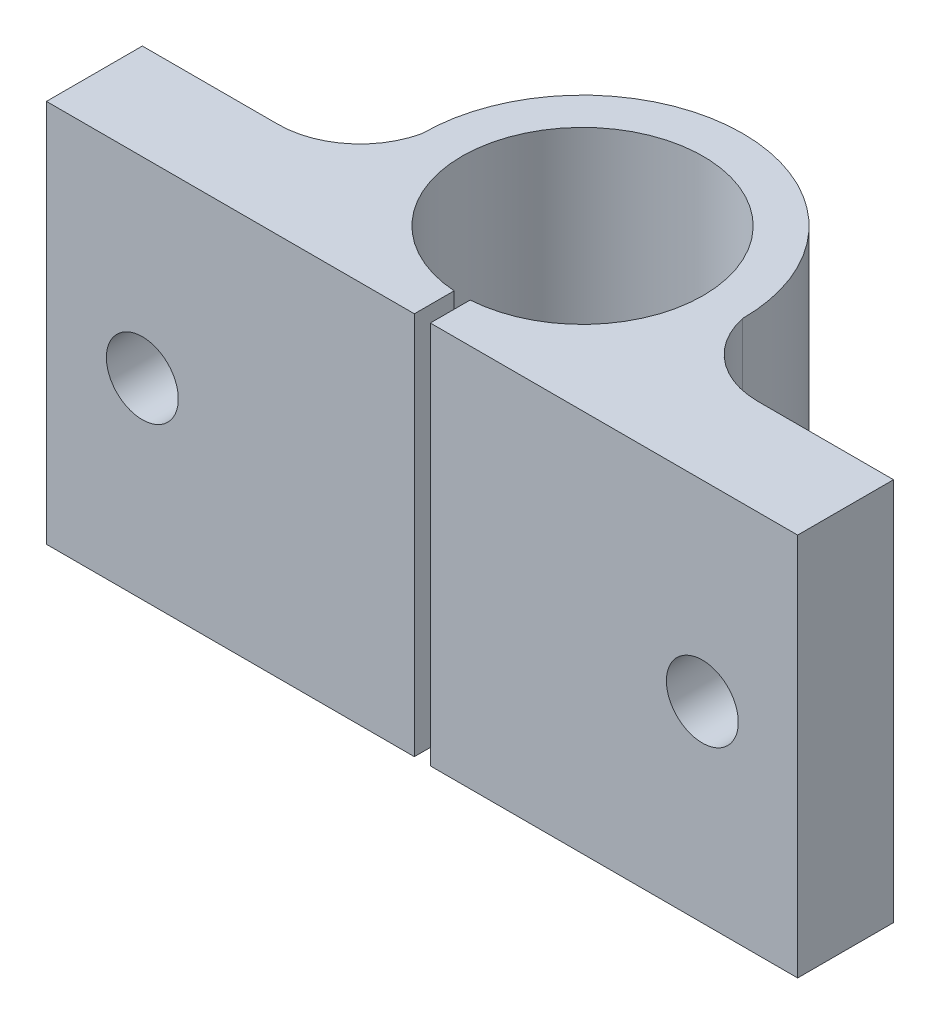
ISO-10303-21;
HEADER;
FILE_DESCRIPTION(('STEP AP214'),'2;1');
FILE_NAME('part.step','',(''),(''),'','','');
FILE_SCHEMA(('AUTOMOTIVE_DESIGN { 1 0 10303 214 1 1 1 1 }'));
ENDSEC;
DATA;
#1=APPLICATION_CONTEXT('core data for automotive mechanical design processes');
#2=APPLICATION_PROTOCOL_DEFINITION('international standard','automotive_design',2000,#1);
#3=PRODUCT_CONTEXT('',#1,'mechanical');
#4=PRODUCT('Part','Part','',(#3));
#5=PRODUCT_RELATED_PRODUCT_CATEGORY('part','',(#4));
#6=PRODUCT_DEFINITION_FORMATION('','',#4);
#7=PRODUCT_DEFINITION_CONTEXT('part definition',#1,'design');
#8=PRODUCT_DEFINITION('design','',#6,#7);
#9=PRODUCT_DEFINITION_SHAPE('','',#8);
#10=(LENGTH_UNIT() NAMED_UNIT(*) SI_UNIT(.MILLI.,.METRE.));
#11=(NAMED_UNIT(*) PLANE_ANGLE_UNIT() SI_UNIT($,.RADIAN.));
#12=(NAMED_UNIT(*) SI_UNIT($,.STERADIAN.) SOLID_ANGLE_UNIT());
#13=UNCERTAINTY_MEASURE_WITH_UNIT(LENGTH_MEASURE(1.E-05),#10,'distance_accuracy_value','');
#14=(GEOMETRIC_REPRESENTATION_CONTEXT(3) GLOBAL_UNCERTAINTY_ASSIGNED_CONTEXT((#13)) GLOBAL_UNIT_ASSIGNED_CONTEXT((#10,
#11,#12)) REPRESENTATION_CONTEXT('',''));
#15=CARTESIAN_POINT('',(0.,0.,0.));
#16=DIRECTION('',(0.,0.,1.));
#17=DIRECTION('',(1.,0.,0.));
#18=AXIS2_PLACEMENT_3D('',#15,#16,#17);
#19=CARTESIAN_POINT('',(0.,0.,0.));
#20=DIRECTION('',(0.,0.,1.));
#21=DIRECTION('',(1.,0.,0.));
#22=AXIS2_PLACEMENT_3D('',#19,#20,#21);
#23=PLANE('',#22);
#24=CARTESIAN_POINT('',(41.0372666212457,12.,0.));
#25=DIRECTION('',(0.,0.,-1.));
#26=DIRECTION('',(-1.,0.,0.));
#27=AXIS2_PLACEMENT_3D('',#24,#25,#26);
#28=CIRCLE('',#27,2.25000000000006);
#29=CARTESIAN_POINT('',(38.7872666212456,12.,0.));
#30=VERTEX_POINT('',#29);
#31=EDGE_CURVE('E222',#30,#30,#28,.T.);
#32=ORIENTED_EDGE('',*,*,#31,.T.);
#33=EDGE_LOOP('',(#32));
#34=FACE_BOUND('',#33,.T.);
#35=DIRECTION('',(0.,-1.,0.));
#36=VECTOR('',#35,1.);
#37=CARTESIAN_POINT('',(24.0186333106229,24.,0.));
#38=LINE('',#37,#36);
#39=CARTESIAN_POINT('',(24.0186333106229,24.,0.));
#40=VERTEX_POINT('',#39);
#41=CARTESIAN_POINT('',(24.0186333106229,0.,0.));
#42=VERTEX_POINT('',#41);
#43=EDGE_CURVE('E234',#40,#42,#38,.T.);
#44=ORIENTED_EDGE('',*,*,#43,.T.);
#45=DIRECTION('',(1.,0.,0.));
#46=VECTOR('',#45,1.);
#47=CARTESIAN_POINT('',(0.,0.,0.));
#48=LINE('',#47,#46);
#49=CARTESIAN_POINT('',(47.,0.,0.));
#50=VERTEX_POINT('',#49);
#51=EDGE_CURVE('E247',#42,#50,#48,.T.);
#52=ORIENTED_EDGE('',*,*,#51,.T.);
#53=DIRECTION('',(0.,1.,0.));
#54=VECTOR('',#53,1.);
#55=CARTESIAN_POINT('',(47.,0.,0.));
#56=LINE('',#55,#54);
#57=CARTESIAN_POINT('',(47.,24.,0.));
#58=VERTEX_POINT('',#57);
#59=EDGE_CURVE('E173',#50,#58,#56,.T.);
#60=ORIENTED_EDGE('',*,*,#59,.T.);
#61=DIRECTION('',(1.,0.,0.));
#62=VECTOR('',#61,1.);
#63=CARTESIAN_POINT('',(0.,24.,0.));
#64=LINE('',#63,#62);
#65=EDGE_CURVE('E147',#40,#58,#64,.T.);
#66=ORIENTED_EDGE('',*,*,#65,.F.);
#67=EDGE_LOOP('',(#44,#52,#60,#66));
#68=FACE_BOUND('',#67,.T.);
#69=ADVANCED_FACE('F32',(#34,#68),#23,.T.);
#70=CARTESIAN_POINT('',(0.,0.,-6.));
#71=DIRECTION('',(-1.,0.,0.));
#72=DIRECTION('',(0.,0.,1.));
#73=AXIS2_PLACEMENT_3D('',#70,#71,#72);
#74=PLANE('',#73);
#75=DIRECTION('',(0.,0.,1.));
#76=VECTOR('',#75,1.);
#77=CARTESIAN_POINT('',(0.,24.,-6.));
#78=LINE('',#77,#76);
#79=CARTESIAN_POINT('',(0.,24.,-6.));
#80=VERTEX_POINT('',#79);
#81=CARTESIAN_POINT('',(0.,24.,0.));
#82=VERTEX_POINT('',#81);
#83=EDGE_CURVE('E144',#80,#82,#78,.T.);
#84=ORIENTED_EDGE('',*,*,#83,.F.);
#85=DIRECTION('',(0.,1.,0.));
#86=VECTOR('',#85,1.);
#87=CARTESIAN_POINT('',(0.,0.,-6.));
#88=LINE('',#87,#86);
#89=CARTESIAN_POINT('',(0.,0.,-6.));
#90=VERTEX_POINT('',#89);
#91=EDGE_CURVE('E11',#90,#80,#88,.T.);
#92=ORIENTED_EDGE('',*,*,#91,.F.);
#93=DIRECTION('',(0.,0.,1.));
#94=VECTOR('',#93,1.);
#95=CARTESIAN_POINT('',(0.,0.,-6.));
#96=LINE('',#95,#94);
#97=CARTESIAN_POINT('',(0.,0.,0.));
#98=VERTEX_POINT('',#97);
#99=EDGE_CURVE('E166',#90,#98,#96,.T.);
#100=ORIENTED_EDGE('',*,*,#99,.T.);
#101=DIRECTION('',(0.,1.,0.));
#102=VECTOR('',#101,1.);
#103=CARTESIAN_POINT('',(0.,0.,0.));
#104=LINE('',#103,#102);
#105=EDGE_CURVE('E36',#98,#82,#104,.T.);
#106=ORIENTED_EDGE('',*,*,#105,.T.);
#107=EDGE_LOOP('',(#84,#92,#100,#106));
#108=FACE_BOUND('',#107,.T.);
#109=ADVANCED_FACE('F34',(#108),#74,.T.);
#110=CARTESIAN_POINT('',(8.50000000000001,0.,-6.));
#111=DIRECTION('',(0.,0.,-1.));
#112=DIRECTION('',(-1.,0.,0.));
#113=AXIS2_PLACEMENT_3D('',#110,#111,#112);
#114=PLANE('',#113);
#115=CARTESIAN_POINT('',(6.,12.,-6.00000000000001));
#116=DIRECTION('',(0.,0.,-1.));
#117=DIRECTION('',(-1.,0.,0.));
#118=AXIS2_PLACEMENT_3D('',#115,#116,#117);
#119=CIRCLE('',#118,2.25000000000007);
#120=CARTESIAN_POINT('',(3.74999999999994,12.,-6.00000000000001));
#121=VERTEX_POINT('',#120);
#122=EDGE_CURVE('E217',#121,#121,#119,.T.);
#123=ORIENTED_EDGE('',*,*,#122,.F.);
#124=EDGE_LOOP('',(#123));
#125=FACE_BOUND('',#124,.T.);
#126=DIRECTION('',(-1.,0.,0.));
#127=VECTOR('',#126,1.);
#128=CARTESIAN_POINT('',(8.50000000000001,24.,-6.));
#129=LINE('',#128,#127);
#130=CARTESIAN_POINT('',(8.50000000000001,24.,-6.00000000000002));
#131=VERTEX_POINT('',#130);
#132=EDGE_CURVE('E164',#131,#80,#129,.T.);
#133=ORIENTED_EDGE('',*,*,#132,.F.);
#134=DIRECTION('',(0.,1.,0.));
#135=VECTOR('',#134,1.);
#136=CARTESIAN_POINT('',(8.50000000000001,0.,-6.00000000000002));
#137=LINE('',#136,#135);
#138=CARTESIAN_POINT('',(8.50000000000001,0.,-6.00000000000002));
#139=VERTEX_POINT('',#138);
#140=EDGE_CURVE('E41',#139,#131,#137,.T.);
#141=ORIENTED_EDGE('',*,*,#140,.F.);
#142=DIRECTION('',(-1.,0.,0.));
#143=VECTOR('',#142,1.);
#144=CARTESIAN_POINT('',(8.50000000000001,0.,-6.));
#145=LINE('',#144,#143);
#146=EDGE_CURVE('E134',#139,#90,#145,.T.);
#147=ORIENTED_EDGE('',*,*,#146,.T.);
#148=ORIENTED_EDGE('',*,*,#91,.T.);
#149=EDGE_LOOP('',(#133,#141,#147,#148));
#150=FACE_BOUND('',#149,.T.);
#151=ADVANCED_FACE('F186',(#125,#150),#114,.T.);
#152=CARTESIAN_POINT('',(8.50000000000001,0.,-11.1210427356607));
#153=DIRECTION('',(0.,1.,0.));
#154=DIRECTION('',(0.,0.,1.));
#155=AXIS2_PLACEMENT_3D('',#152,#153,#154);
#156=CYLINDRICAL_SURFACE('',#155,5.12104273566066);
#157=CARTESIAN_POINT('',(8.50000000000001,24.,-11.1210427356607));
#158=DIRECTION('',(0.,-1.,0.));
#159=DIRECTION('',(0.,0.,-1.));
#160=AXIS2_PLACEMENT_3D('',#157,#158,#159);
#161=CIRCLE('',#160,5.12104273566066);
#162=CARTESIAN_POINT('',(13.4959473897421,24.,-9.99605901160399));
#163=VERTEX_POINT('',#162);
#164=EDGE_CURVE('E120',#163,#131,#161,.T.);
#165=ORIENTED_EDGE('',*,*,#164,.F.);
#166=DIRECTION('',(0.,1.,0.));
#167=VECTOR('',#166,1.);
#168=CARTESIAN_POINT('',(13.4959473897421,0.,-9.99605901160399));
#169=LINE('',#168,#167);
#170=CARTESIAN_POINT('',(13.4959473897421,0.,-9.99605901160399));
#171=VERTEX_POINT('',#170);
#172=EDGE_CURVE('E114',#171,#163,#169,.T.);
#173=ORIENTED_EDGE('',*,*,#172,.F.);
#174=CARTESIAN_POINT('',(8.50000000000001,0.,-11.1210427356607));
#175=DIRECTION('',(0.,-1.,0.));
#176=DIRECTION('',(0.,0.,-1.));
#177=AXIS2_PLACEMENT_3D('',#174,#175,#176);
#178=CIRCLE('',#177,5.12104273566066);
#179=EDGE_CURVE('E117',#171,#139,#178,.T.);
#180=ORIENTED_EDGE('',*,*,#179,.T.);
#181=ORIENTED_EDGE('',*,*,#140,.T.);
#182=EDGE_LOOP('',(#165,#173,#180,#181));
#183=FACE_BOUND('',#182,.T.);
#184=ADVANCED_FACE('F116',(#183),#156,.F.);
#185=CARTESIAN_POINT('',(23.5186333106229,0.,-10.0227213844719));
#186=DIRECTION('',(0.,1.,0.));
#187=DIRECTION('',(0.,0.,1.));
#188=AXIS2_PLACEMENT_3D('',#185,#186,#187);
#189=CYLINDRICAL_SURFACE('',#188,10.0227213844719);
#190=CARTESIAN_POINT('',(23.5186333106229,24.,-10.0227213844719));
#191=DIRECTION('',(0.,1.,0.));
#192=DIRECTION('',(0.,0.,1.));
#193=AXIS2_PLACEMENT_3D('',#190,#191,#192);
#194=CIRCLE('',#193,10.0227213844719);
#195=CARTESIAN_POINT('',(33.5413546555968,24.,-10.021831577252));
#196=VERTEX_POINT('',#195);
#197=EDGE_CURVE('E161',#196,#163,#194,.T.);
#198=ORIENTED_EDGE('',*,*,#197,.F.);
#199=DIRECTION('',(0.,1.,0.));
#200=VECTOR('',#199,1.);
#201=CARTESIAN_POINT('',(33.5413546555968,0.,-10.021831577252));
#202=LINE('',#201,#200);
#203=CARTESIAN_POINT('',(33.5413546555968,0.,-10.021831577252));
#204=VERTEX_POINT('',#203);
#205=EDGE_CURVE('E125',#204,#196,#202,.T.);
#206=ORIENTED_EDGE('',*,*,#205,.F.);
#207=CARTESIAN_POINT('',(23.5186333106229,0.,-10.0227213844719));
#208=DIRECTION('',(0.,1.,0.));
#209=DIRECTION('',(0.,0.,1.));
#210=AXIS2_PLACEMENT_3D('',#207,#208,#209);
#211=CIRCLE('',#210,10.0227213844719);
#212=EDGE_CURVE('E132',#204,#171,#211,.T.);
#213=ORIENTED_EDGE('',*,*,#212,.T.);
#214=ORIENTED_EDGE('',*,*,#172,.T.);
#215=EDGE_LOOP('',(#198,#206,#213,#214));
#216=FACE_BOUND('',#215,.T.);
#217=ADVANCED_FACE('F136',(#216),#189,.T.);
#218=CARTESIAN_POINT('',(38.5000000000001,0.,-11.0677523541657));
#219=DIRECTION('',(0.,1.,0.));
#220=DIRECTION('',(0.,0.,1.));
#221=AXIS2_PLACEMENT_3D('',#218,#219,#220);
#222=CYLINDRICAL_SURFACE('',#221,5.06775235416579);
#223=CARTESIAN_POINT('',(38.5000000000001,24.,-11.0677523541657));
#224=DIRECTION('',(0.,-1.,0.));
#225=DIRECTION('',(0.,0.,-1.));
#226=AXIS2_PLACEMENT_3D('',#223,#224,#225);
#227=CIRCLE('',#226,5.06775235416579);
#228=CARTESIAN_POINT('',(38.5,24.,-6.00000000000001));
#229=VERTEX_POINT('',#228);
#230=EDGE_CURVE('E158',#229,#196,#227,.T.);
#231=ORIENTED_EDGE('',*,*,#230,.F.);
#232=DIRECTION('',(0.,1.,0.));
#233=VECTOR('',#232,1.);
#234=CARTESIAN_POINT('',(38.5,0.,-6.00000000000001));
#235=LINE('',#234,#233);
#236=CARTESIAN_POINT('',(38.5,0.,-6.00000000000001));
#237=VERTEX_POINT('',#236);
#238=EDGE_CURVE('E170',#237,#229,#235,.T.);
#239=ORIENTED_EDGE('',*,*,#238,.F.);
#240=CARTESIAN_POINT('',(38.5000000000001,0.,-11.0677523541657));
#241=DIRECTION('',(0.,-1.,0.));
#242=DIRECTION('',(0.,0.,-1.));
#243=AXIS2_PLACEMENT_3D('',#240,#241,#242);
#244=CIRCLE('',#243,5.06775235416579);
#245=EDGE_CURVE('E137',#237,#204,#244,.T.);
#246=ORIENTED_EDGE('',*,*,#245,.T.);
#247=ORIENTED_EDGE('',*,*,#205,.T.);
#248=EDGE_LOOP('',(#231,#239,#246,#247));
#249=FACE_BOUND('',#248,.T.);
#250=ADVANCED_FACE('F305',(#249),#222,.F.);
#251=CARTESIAN_POINT('',(47.,0.,-6.));
#252=DIRECTION('',(0.,0.,-1.));
#253=DIRECTION('',(-1.,0.,0.));
#254=AXIS2_PLACEMENT_3D('',#251,#252,#253);
#255=PLANE('',#254);
#256=CARTESIAN_POINT('',(41.0372666212457,12.,-6.00000000000001));
#257=DIRECTION('',(0.,0.,-1.));
#258=DIRECTION('',(-1.,0.,0.));
#259=AXIS2_PLACEMENT_3D('',#256,#257,#258);
#260=CIRCLE('',#259,2.25000000000006);
#261=CARTESIAN_POINT('',(38.7872666212456,12.,-6.00000000000001));
#262=VERTEX_POINT('',#261);
#263=EDGE_CURVE('E301',#262,#262,#260,.T.);
#264=ORIENTED_EDGE('',*,*,#263,.F.);
#265=EDGE_LOOP('',(#264));
#266=FACE_BOUND('',#265,.T.);
#267=DIRECTION('',(-1.,0.,0.));
#268=VECTOR('',#267,1.);
#269=CARTESIAN_POINT('',(47.,24.,-6.));
#270=LINE('',#269,#268);
#271=CARTESIAN_POINT('',(47.,24.,-6.));
#272=VERTEX_POINT('',#271);
#273=EDGE_CURVE('E155',#272,#229,#270,.T.);
#274=ORIENTED_EDGE('',*,*,#273,.F.);
#275=DIRECTION('',(0.,1.,0.));
#276=VECTOR('',#275,1.);
#277=CARTESIAN_POINT('',(47.,0.,-6.));
#278=LINE('',#277,#276);
#279=CARTESIAN_POINT('',(47.,0.,-6.));
#280=VERTEX_POINT('',#279);
#281=EDGE_CURVE('E172',#280,#272,#278,.T.);
#282=ORIENTED_EDGE('',*,*,#281,.F.);
#283=DIRECTION('',(-1.,0.,0.));
#284=VECTOR('',#283,1.);
#285=CARTESIAN_POINT('',(47.,0.,-6.));
#286=LINE('',#285,#284);
#287=EDGE_CURVE('E139',#280,#237,#286,.T.);
#288=ORIENTED_EDGE('',*,*,#287,.T.);
#289=ORIENTED_EDGE('',*,*,#238,.T.);
#290=EDGE_LOOP('',(#274,#282,#288,#289));
#291=FACE_BOUND('',#290,.T.);
#292=ADVANCED_FACE('F211',(#266,#291),#255,.T.);
#293=CARTESIAN_POINT('',(47.,0.,0.));
#294=DIRECTION('',(1.,0.,0.));
#295=DIRECTION('',(0.,0.,-1.));
#296=AXIS2_PLACEMENT_3D('',#293,#294,#295);
#297=PLANE('',#296);
#298=DIRECTION('',(0.,0.,-1.));
#299=VECTOR('',#298,1.);
#300=CARTESIAN_POINT('',(47.,24.,0.));
#301=LINE('',#300,#299);
#302=EDGE_CURVE('E152',#58,#272,#301,.T.);
#303=ORIENTED_EDGE('',*,*,#302,.F.);
#304=ORIENTED_EDGE('',*,*,#59,.F.);
#305=DIRECTION('',(0.,0.,-1.));
#306=VECTOR('',#305,1.);
#307=CARTESIAN_POINT('',(47.,0.,0.));
#308=LINE('',#307,#306);
#309=EDGE_CURVE('E250',#50,#280,#308,.T.);
#310=ORIENTED_EDGE('',*,*,#309,.T.);
#311=ORIENTED_EDGE('',*,*,#281,.T.);
#312=EDGE_LOOP('',(#303,#304,#310,#311));
#313=FACE_BOUND('',#312,.T.);
#314=ADVANCED_FACE('F204',(#313),#297,.T.);
#315=CARTESIAN_POINT('',(6.,12.,0.));
#316=DIRECTION('',(0.,0.,-1.));
#317=DIRECTION('',(-1.,0.,0.));
#318=AXIS2_PLACEMENT_3D('',#315,#316,#317);
#319=CIRCLE('',#318,2.25000000000007);
#320=CARTESIAN_POINT('',(3.74999999999994,12.,0.));
#321=VERTEX_POINT('',#320);
#322=EDGE_CURVE('E215',#321,#321,#319,.T.);
#323=ORIENTED_EDGE('',*,*,#322,.T.);
#324=EDGE_LOOP('',(#323));
#325=FACE_BOUND('',#324,.T.);
#326=DIRECTION('',(0.,-1.,0.));
#327=VECTOR('',#326,1.);
#328=CARTESIAN_POINT('',(23.0186333106229,24.,0.));
#329=LINE('',#328,#327);
#330=CARTESIAN_POINT('',(23.0186333106229,24.,0.));
#331=VERTEX_POINT('',#330);
#332=CARTESIAN_POINT('',(23.0186333106229,0.,0.));
#333=VERTEX_POINT('',#332);
#334=EDGE_CURVE('E182',#331,#333,#329,.T.);
#335=ORIENTED_EDGE('',*,*,#334,.F.);
#336=EDGE_CURVE('E149',#82,#331,#64,.T.);
#337=ORIENTED_EDGE('',*,*,#336,.F.);
#338=ORIENTED_EDGE('',*,*,#105,.F.);
#339=EDGE_CURVE('E248',#98,#333,#48,.T.);
#340=ORIENTED_EDGE('',*,*,#339,.T.);
#341=EDGE_LOOP('',(#335,#337,#338,#340));
#342=FACE_BOUND('',#341,.T.);
#343=ADVANCED_FACE('F180',(#325,#342),#23,.T.);
#344=CARTESIAN_POINT('',(38.5000000000001,0.,-11.0677523541657));
#345=DIRECTION('',(0.,-1.,0.));
#346=DIRECTION('',(0.,0.,-1.));
#347=AXIS2_PLACEMENT_3D('',#344,#345,#346);
#348=PLANE('',#347);
#349=CARTESIAN_POINT('',(23.5186333106229,0.,-10.022721384472));
#350=DIRECTION('',(0.,1.,0.));
#351=DIRECTION('',(0.,0.,1.));
#352=AXIS2_PLACEMENT_3D('',#349,#350,#351);
#353=CIRCLE('',#352,7.55000000000005);
#354=CARTESIAN_POINT('',(24.0186333106229,0.,-2.48929586881175));
#355=VERTEX_POINT('',#354);
#356=CARTESIAN_POINT('',(23.0186333106229,0.,-2.48929586881175));
#357=VERTEX_POINT('',#356);
#358=EDGE_CURVE('E219',#355,#357,#353,.T.);
#359=ORIENTED_EDGE('',*,*,#358,.T.);
#360=DIRECTION('',(0.,0.,-1.));
#361=VECTOR('',#360,1.);
#362=CARTESIAN_POINT('',(23.0186333106229,0.,0.));
#363=LINE('',#362,#361);
#364=EDGE_CURVE('E232',#333,#357,#363,.T.);
#365=ORIENTED_EDGE('',*,*,#364,.F.);
#366=ORIENTED_EDGE('',*,*,#339,.F.);
#367=ORIENTED_EDGE('',*,*,#99,.F.);
#368=ORIENTED_EDGE('',*,*,#146,.F.);
#369=ORIENTED_EDGE('',*,*,#179,.F.);
#370=ORIENTED_EDGE('',*,*,#212,.F.);
#371=ORIENTED_EDGE('',*,*,#245,.F.);
#372=ORIENTED_EDGE('',*,*,#287,.F.);
#373=ORIENTED_EDGE('',*,*,#309,.F.);
#374=ORIENTED_EDGE('',*,*,#51,.F.);
#375=DIRECTION('',(0.,0.,1.));
#376=VECTOR('',#375,1.);
#377=CARTESIAN_POINT('',(24.0186333106229,0.,-2.48929586881175));
#378=LINE('',#377,#376);
#379=EDGE_CURVE('E227',#355,#42,#378,.T.);
#380=ORIENTED_EDGE('',*,*,#379,.F.);
#381=EDGE_LOOP('',(#359,#365,#366,#367,#368,#369,#370,#371,#372,#373,#374,#380));
#382=FACE_BOUND('',#381,.T.);
#383=ADVANCED_FACE('F130',(#382),#348,.T.);
#384=CARTESIAN_POINT('',(38.5000000000001,24.,-11.0677523541657));
#385=DIRECTION('',(0.,-1.,0.));
#386=DIRECTION('',(0.,0.,-1.));
#387=AXIS2_PLACEMENT_3D('',#384,#385,#386);
#388=PLANE('',#387);
#389=DIRECTION('',(0.,0.,-1.));
#390=VECTOR('',#389,1.);
#391=CARTESIAN_POINT('',(23.0186333106229,24.,0.));
#392=LINE('',#391,#390);
#393=CARTESIAN_POINT('',(23.0186333106229,24.,-2.48929586881175));
#394=VERTEX_POINT('',#393);
#395=EDGE_CURVE('E231',#331,#394,#392,.T.);
#396=ORIENTED_EDGE('',*,*,#395,.T.);
#397=CARTESIAN_POINT('',(23.5186333106229,24.,-10.022721384472));
#398=DIRECTION('',(0.,1.,0.));
#399=DIRECTION('',(0.,0.,1.));
#400=AXIS2_PLACEMENT_3D('',#397,#398,#399);
#401=CIRCLE('',#400,7.55000000000005);
#402=CARTESIAN_POINT('',(24.0186333106229,24.,-2.48929586881175));
#403=VERTEX_POINT('',#402);
#404=EDGE_CURVE('E49',#403,#394,#401,.T.);
#405=ORIENTED_EDGE('',*,*,#404,.F.);
#406=DIRECTION('',(0.,0.,1.));
#407=VECTOR('',#406,1.);
#408=CARTESIAN_POINT('',(24.0186333106229,24.,-2.48929586881175));
#409=LINE('',#408,#407);
#410=EDGE_CURVE('E228',#403,#40,#409,.T.);
#411=ORIENTED_EDGE('',*,*,#410,.T.);
#412=ORIENTED_EDGE('',*,*,#65,.T.);
#413=ORIENTED_EDGE('',*,*,#302,.T.);
#414=ORIENTED_EDGE('',*,*,#273,.T.);
#415=ORIENTED_EDGE('',*,*,#230,.T.);
#416=ORIENTED_EDGE('',*,*,#197,.T.);
#417=ORIENTED_EDGE('',*,*,#164,.T.);
#418=ORIENTED_EDGE('',*,*,#132,.T.);
#419=ORIENTED_EDGE('',*,*,#83,.T.);
#420=ORIENTED_EDGE('',*,*,#336,.T.);
#421=EDGE_LOOP('',(#396,#405,#411,#412,#413,#414,#415,#416,#417,#418,#419,#420));
#422=FACE_BOUND('',#421,.T.);
#423=ADVANCED_FACE('F185',(#422),#388,.F.);
#424=CARTESIAN_POINT('',(24.0186333106229,24.,-2.48929586881175));
#425=DIRECTION('',(1.,0.,0.));
#426=DIRECTION('',(0.,0.,-1.));
#427=AXIS2_PLACEMENT_3D('',#424,#425,#426);
#428=PLANE('',#427);
#429=ORIENTED_EDGE('',*,*,#379,.T.);
#430=ORIENTED_EDGE('',*,*,#43,.F.);
#431=ORIENTED_EDGE('',*,*,#410,.F.);
#432=DIRECTION('',(0.,-1.,0.));
#433=VECTOR('',#432,1.);
#434=CARTESIAN_POINT('',(24.0186333106229,24.,-2.48929586881175));
#435=LINE('',#434,#433);
#436=EDGE_CURVE('E148',#403,#355,#435,.T.);
#437=ORIENTED_EDGE('',*,*,#436,.T.);
#438=EDGE_LOOP('',(#429,#430,#431,#437));
#439=FACE_BOUND('',#438,.T.);
#440=ADVANCED_FACE('F276',(#439),#428,.F.);
#441=CARTESIAN_POINT('',(23.0186333106229,24.,0.));
#442=DIRECTION('',(-1.,0.,0.));
#443=DIRECTION('',(0.,0.,1.));
#444=AXIS2_PLACEMENT_3D('',#441,#442,#443);
#445=PLANE('',#444);
#446=ORIENTED_EDGE('',*,*,#364,.T.);
#447=DIRECTION('',(0.,-1.,0.));
#448=VECTOR('',#447,1.);
#449=CARTESIAN_POINT('',(23.0186333106229,24.,-2.48929586881175));
#450=LINE('',#449,#448);
#451=EDGE_CURVE('E241',#394,#357,#450,.T.);
#452=ORIENTED_EDGE('',*,*,#451,.F.);
#453=ORIENTED_EDGE('',*,*,#395,.F.);
#454=ORIENTED_EDGE('',*,*,#334,.T.);
#455=EDGE_LOOP('',(#446,#452,#453,#454));
#456=FACE_BOUND('',#455,.T.);
#457=ADVANCED_FACE('F278',(#456),#445,.F.);
#458=CARTESIAN_POINT('',(23.5186333106229,0.,-10.022721384472));
#459=DIRECTION('',(0.,1.,0.));
#460=DIRECTION('',(0.,0.,1.));
#461=AXIS2_PLACEMENT_3D('',#458,#459,#460);
#462=CYLINDRICAL_SURFACE('',#461,7.55000000000005);
#463=ORIENTED_EDGE('',*,*,#404,.T.);
#464=ORIENTED_EDGE('',*,*,#451,.T.);
#465=ORIENTED_EDGE('',*,*,#358,.F.);
#466=ORIENTED_EDGE('',*,*,#436,.F.);
#467=EDGE_LOOP('',(#463,#464,#465,#466));
#468=FACE_BOUND('',#467,.T.);
#469=ADVANCED_FACE('F275',(#468),#462,.F.);
#470=CARTESIAN_POINT('',(6.,12.,-6.00000000000001));
#471=DIRECTION('',(0.,0.,-1.));
#472=DIRECTION('',(-1.,0.,0.));
#473=AXIS2_PLACEMENT_3D('',#470,#471,#472);
#474=CYLINDRICAL_SURFACE('',#473,2.25000000000007);
#475=ORIENTED_EDGE('',*,*,#322,.F.);
#476=EDGE_LOOP('',(#475));
#477=FACE_BOUND('',#476,.T.);
#478=ORIENTED_EDGE('',*,*,#122,.T.);
#479=EDGE_LOOP('',(#478));
#480=FACE_BOUND('',#479,.T.);
#481=ADVANCED_FACE('F289',(#477,#480),#474,.F.);
#482=CARTESIAN_POINT('',(41.0372666212457,12.,-6.00000000000001));
#483=DIRECTION('',(0.,0.,-1.));
#484=DIRECTION('',(-1.,0.,0.));
#485=AXIS2_PLACEMENT_3D('',#482,#483,#484);
#486=CYLINDRICAL_SURFACE('',#485,2.25000000000006);
#487=ORIENTED_EDGE('',*,*,#31,.F.);
#488=EDGE_LOOP('',(#487));
#489=FACE_BOUND('',#488,.T.);
#490=ORIENTED_EDGE('',*,*,#263,.T.);
#491=EDGE_LOOP('',(#490));
#492=FACE_BOUND('',#491,.T.);
#493=ADVANCED_FACE('F292',(#489,#492),#486,.F.);
#494=CLOSED_SHELL('',(#69,#109,#151,#184,#217,#250,#292,#314,#343,#383,#423,#440,#457,#469,#481,#493));
#495=MANIFOLD_SOLID_BREP('B2',#494);
#496=ADVANCED_BREP_SHAPE_REPRESENTATION('',(#18,#495),#14);
#497=SHAPE_DEFINITION_REPRESENTATION(#9,#496);
ENDSEC;
END-ISO-10303-21;
